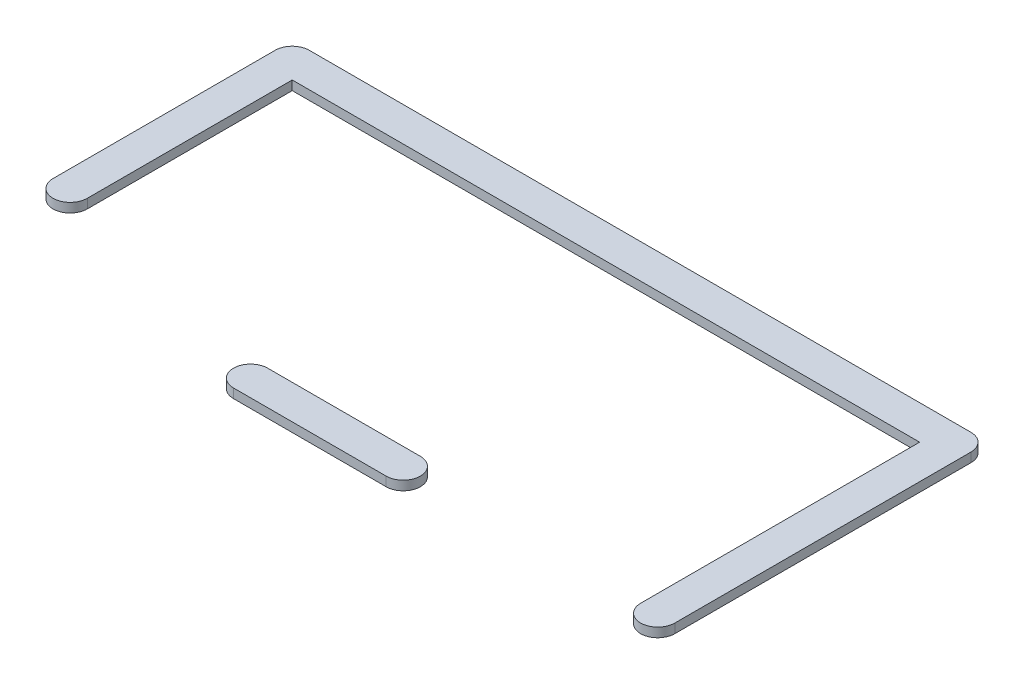
ISO-10303-21;
HEADER;
FILE_DESCRIPTION(('STEP AP214'),'2;1');
FILE_NAME('part.step','',(''),(''),'','','');
FILE_SCHEMA(('AUTOMOTIVE_DESIGN { 1 0 10303 214 1 1 1 1 }'));
ENDSEC;
DATA;
#1=APPLICATION_CONTEXT('core data for automotive mechanical design processes');
#2=APPLICATION_PROTOCOL_DEFINITION('international standard','automotive_design',2000,#1);
#3=PRODUCT_CONTEXT('',#1,'mechanical');
#4=PRODUCT('Part','Part','',(#3));
#5=PRODUCT_RELATED_PRODUCT_CATEGORY('part','',(#4));
#6=PRODUCT_DEFINITION_FORMATION('','',#4);
#7=PRODUCT_DEFINITION_CONTEXT('part definition',#1,'design');
#8=PRODUCT_DEFINITION('design','',#6,#7);
#9=PRODUCT_DEFINITION_SHAPE('','',#8);
#10=(LENGTH_UNIT() NAMED_UNIT(*) SI_UNIT(.MILLI.,.METRE.));
#11=(NAMED_UNIT(*) PLANE_ANGLE_UNIT() SI_UNIT($,.RADIAN.));
#12=(NAMED_UNIT(*) SI_UNIT($,.STERADIAN.) SOLID_ANGLE_UNIT());
#13=UNCERTAINTY_MEASURE_WITH_UNIT(LENGTH_MEASURE(1.E-05),#10,'distance_accuracy_value','');
#14=(GEOMETRIC_REPRESENTATION_CONTEXT(3) GLOBAL_UNCERTAINTY_ASSIGNED_CONTEXT((#13)) GLOBAL_UNIT_ASSIGNED_CONTEXT((#10,
#11,#12)) REPRESENTATION_CONTEXT('',''));
#15=CARTESIAN_POINT('',(0.,0.,0.));
#16=DIRECTION('',(0.,0.,1.));
#17=DIRECTION('',(1.,0.,0.));
#18=AXIS2_PLACEMENT_3D('',#15,#16,#17);
#19=CARTESIAN_POINT('',(550.,-20.,640.));
#20=DIRECTION('',(0.,1.,0.));
#21=DIRECTION('',(0.,0.,1.));
#22=AXIS2_PLACEMENT_3D('',#19,#20,#21);
#23=CYLINDRICAL_SURFACE('',#22,37.);
#24=CARTESIAN_POINT('',(550.,0.,640.));
#25=DIRECTION('',(0.,1.,0.));
#26=DIRECTION('',(0.,0.,1.));
#27=AXIS2_PLACEMENT_3D('',#24,#25,#26);
#28=CIRCLE('',#27,37.);
#29=CARTESIAN_POINT('',(550.,0.,603.));
#30=VERTEX_POINT('',#29);
#31=CARTESIAN_POINT('',(550.,0.,677.));
#32=VERTEX_POINT('',#31);
#33=EDGE_CURVE('E111',#30,#32,#28,.T.);
#34=ORIENTED_EDGE('',*,*,#33,.F.);
#35=DIRECTION('',(0.,1.,0.));
#36=VECTOR('',#35,1.);
#37=CARTESIAN_POINT('',(550.,-20.,603.));
#38=LINE('',#37,#36);
#39=CARTESIAN_POINT('',(550.,-20.,603.));
#40=VERTEX_POINT('',#39);
#41=EDGE_CURVE('E12',#40,#30,#38,.T.);
#42=ORIENTED_EDGE('',*,*,#41,.F.);
#43=CARTESIAN_POINT('',(550.,-20.,640.));
#44=DIRECTION('',(0.,1.,0.));
#45=DIRECTION('',(0.,0.,1.));
#46=AXIS2_PLACEMENT_3D('',#43,#44,#45);
#47=CIRCLE('',#46,37.);
#48=CARTESIAN_POINT('',(550.,-20.,677.));
#49=VERTEX_POINT('',#48);
#50=EDGE_CURVE('E105',#40,#49,#47,.T.);
#51=ORIENTED_EDGE('',*,*,#50,.T.);
#52=DIRECTION('',(0.,1.,0.));
#53=VECTOR('',#52,1.);
#54=CARTESIAN_POINT('',(550.,-20.,677.));
#55=LINE('',#54,#53);
#56=EDGE_CURVE('E50',#49,#32,#55,.T.);
#57=ORIENTED_EDGE('',*,*,#56,.T.);
#58=EDGE_LOOP('',(#34,#42,#51,#57));
#59=FACE_BOUND('',#58,.T.);
#60=ADVANCED_FACE('F47',(#59),#23,.T.);
#61=CARTESIAN_POINT('',(550.,-20.,603.));
#62=DIRECTION('',(0.,0.,-1.));
#63=DIRECTION('',(-1.,0.,0.));
#64=AXIS2_PLACEMENT_3D('',#61,#62,#63);
#65=PLANE('',#64);
#66=DIRECTION('',(-1.,0.,0.));
#67=VECTOR('',#66,1.);
#68=CARTESIAN_POINT('',(550.,0.,603.));
#69=LINE('',#68,#67);
#70=CARTESIAN_POINT('',(880.,0.,603.));
#71=VERTEX_POINT('',#70);
#72=EDGE_CURVE('E107',#71,#30,#69,.T.);
#73=ORIENTED_EDGE('',*,*,#72,.F.);
#74=DIRECTION('',(0.,1.,0.));
#75=VECTOR('',#74,1.);
#76=CARTESIAN_POINT('',(880.,-20.,603.));
#77=LINE('',#76,#75);
#78=CARTESIAN_POINT('',(880.,-20.,603.));
#79=VERTEX_POINT('',#78);
#80=EDGE_CURVE('E56',#79,#71,#77,.T.);
#81=ORIENTED_EDGE('',*,*,#80,.F.);
#82=DIRECTION('',(-1.,0.,0.));
#83=VECTOR('',#82,1.);
#84=CARTESIAN_POINT('',(550.,-20.,603.));
#85=LINE('',#84,#83);
#86=EDGE_CURVE('E102',#79,#40,#85,.T.);
#87=ORIENTED_EDGE('',*,*,#86,.T.);
#88=ORIENTED_EDGE('',*,*,#41,.T.);
#89=EDGE_LOOP('',(#73,#81,#87,#88));
#90=FACE_BOUND('',#89,.T.);
#91=ADVANCED_FACE('F121',(#90),#65,.T.);
#92=CARTESIAN_POINT('',(880.,-20.,640.));
#93=DIRECTION('',(0.,1.,0.));
#94=DIRECTION('',(0.,0.,1.));
#95=AXIS2_PLACEMENT_3D('',#92,#93,#94);
#96=CYLINDRICAL_SURFACE('',#95,37.);
#97=CARTESIAN_POINT('',(880.,0.,640.));
#98=DIRECTION('',(0.,1.,0.));
#99=DIRECTION('',(0.,0.,-1.));
#100=AXIS2_PLACEMENT_3D('',#97,#98,#99);
#101=CIRCLE('',#100,37.);
#102=CARTESIAN_POINT('',(880.,0.,677.));
#103=VERTEX_POINT('',#102);
#104=EDGE_CURVE('E97',#103,#71,#101,.T.);
#105=ORIENTED_EDGE('',*,*,#104,.F.);
#106=DIRECTION('',(0.,1.,0.));
#107=VECTOR('',#106,1.);
#108=CARTESIAN_POINT('',(880.,-20.,677.));
#109=LINE('',#108,#107);
#110=CARTESIAN_POINT('',(880.,-20.,677.));
#111=VERTEX_POINT('',#110);
#112=EDGE_CURVE('E92',#111,#103,#109,.T.);
#113=ORIENTED_EDGE('',*,*,#112,.F.);
#114=CARTESIAN_POINT('',(880.,-20.,640.));
#115=DIRECTION('',(0.,1.,0.));
#116=DIRECTION('',(0.,0.,-1.));
#117=AXIS2_PLACEMENT_3D('',#114,#115,#116);
#118=CIRCLE('',#117,37.);
#119=EDGE_CURVE('E95',#111,#79,#118,.T.);
#120=ORIENTED_EDGE('',*,*,#119,.T.);
#121=ORIENTED_EDGE('',*,*,#80,.T.);
#122=EDGE_LOOP('',(#105,#113,#120,#121));
#123=FACE_BOUND('',#122,.T.);
#124=ADVANCED_FACE('F94',(#123),#96,.T.);
#125=CARTESIAN_POINT('',(550.,-20.,677.));
#126=DIRECTION('',(0.,0.,1.));
#127=DIRECTION('',(1.,0.,0.));
#128=AXIS2_PLACEMENT_3D('',#125,#126,#127);
#129=PLANE('',#128);
#130=DIRECTION('',(1.,0.,0.));
#131=VECTOR('',#130,1.);
#132=CARTESIAN_POINT('',(550.,0.,677.));
#133=LINE('',#132,#131);
#134=EDGE_CURVE('E114',#32,#103,#133,.T.);
#135=ORIENTED_EDGE('',*,*,#134,.F.);
#136=ORIENTED_EDGE('',*,*,#56,.F.);
#137=DIRECTION('',(1.,0.,0.));
#138=VECTOR('',#137,1.);
#139=CARTESIAN_POINT('',(550.,-20.,677.));
#140=LINE('',#139,#138);
#141=EDGE_CURVE('E101',#49,#111,#140,.T.);
#142=ORIENTED_EDGE('',*,*,#141,.T.);
#143=ORIENTED_EDGE('',*,*,#112,.T.);
#144=EDGE_LOOP('',(#135,#136,#142,#143));
#145=FACE_BOUND('',#144,.T.);
#146=ADVANCED_FACE('F104',(#145),#129,.T.);
#147=CARTESIAN_POINT('',(550.,-20.,640.));
#148=DIRECTION('',(0.,1.,0.));
#149=DIRECTION('',(0.,0.,1.));
#150=AXIS2_PLACEMENT_3D('',#147,#148,#149);
#151=PLANE('',#150);
#152=ORIENTED_EDGE('',*,*,#50,.F.);
#153=ORIENTED_EDGE('',*,*,#86,.F.);
#154=ORIENTED_EDGE('',*,*,#119,.F.);
#155=ORIENTED_EDGE('',*,*,#141,.F.);
#156=EDGE_LOOP('',(#152,#153,#154,#155));
#157=FACE_BOUND('',#156,.T.);
#158=ADVANCED_FACE('F100',(#157),#151,.F.);
#159=CARTESIAN_POINT('',(550.,0.,640.));
#160=DIRECTION('',(0.,1.,0.));
#161=DIRECTION('',(0.,0.,1.));
#162=AXIS2_PLACEMENT_3D('',#159,#160,#161);
#163=PLANE('',#162);
#164=ORIENTED_EDGE('',*,*,#33,.T.);
#165=ORIENTED_EDGE('',*,*,#134,.T.);
#166=ORIENTED_EDGE('',*,*,#104,.T.);
#167=ORIENTED_EDGE('',*,*,#72,.T.);
#168=EDGE_LOOP('',(#164,#165,#166,#167));
#169=FACE_BOUND('',#168,.T.);
#170=ADVANCED_FACE('F120',(#169),#163,.T.);
#171=CLOSED_SHELL('',(#60,#91,#124,#146,#158,#170));
#172=MANIFOLD_SOLID_BREP('B2',#171);
#173=CARTESIAN_POINT('',(1430.,-20.,0.));
#174=DIRECTION('',(0.,1.,0.));
#175=DIRECTION('',(0.,0.,1.));
#176=AXIS2_PLACEMENT_3D('',#173,#174,#175);
#177=CYLINDRICAL_SURFACE('',#176,37.);
#178=CARTESIAN_POINT('',(1430.,0.,0.));
#179=DIRECTION('',(0.,1.,0.));
#180=DIRECTION('',(0.,0.,1.));
#181=AXIS2_PLACEMENT_3D('',#178,#179,#180);
#182=CIRCLE('',#181,37.);
#183=CARTESIAN_POINT('',(1467.,0.,0.));
#184=VERTEX_POINT('',#183);
#185=CARTESIAN_POINT('',(1430.,0.,-37.));
#186=VERTEX_POINT('',#185);
#187=EDGE_CURVE('E280',#184,#186,#182,.T.);
#188=ORIENTED_EDGE('',*,*,#187,.F.);
#189=DIRECTION('',(0.,1.,0.));
#190=VECTOR('',#189,1.);
#191=CARTESIAN_POINT('',(1467.,-20.,0.));
#192=LINE('',#191,#190);
#193=CARTESIAN_POINT('',(1467.,-20.,0.));
#194=VERTEX_POINT('',#193);
#195=EDGE_CURVE('E45',#194,#184,#192,.T.);
#196=ORIENTED_EDGE('',*,*,#195,.F.);
#197=CARTESIAN_POINT('',(1430.,-20.,0.));
#198=DIRECTION('',(0.,1.,0.));
#199=DIRECTION('',(0.,0.,1.));
#200=AXIS2_PLACEMENT_3D('',#197,#198,#199);
#201=CIRCLE('',#200,37.);
#202=CARTESIAN_POINT('',(1430.,-20.,-37.));
#203=VERTEX_POINT('',#202);
#204=EDGE_CURVE('E306',#194,#203,#201,.T.);
#205=ORIENTED_EDGE('',*,*,#204,.T.);
#206=DIRECTION('',(0.,1.,0.));
#207=VECTOR('',#206,1.);
#208=CARTESIAN_POINT('',(1430.,-20.,-37.));
#209=LINE('',#208,#207);
#210=EDGE_CURVE('E174',#203,#186,#209,.T.);
#211=ORIENTED_EDGE('',*,*,#210,.T.);
#212=EDGE_LOOP('',(#188,#196,#205,#211));
#213=FACE_BOUND('',#212,.T.);
#214=ADVANCED_FACE('F171',(#213),#177,.T.);
#215=CARTESIAN_POINT('',(1467.,-20.,0.));
#216=DIRECTION('',(1.,0.,0.));
#217=DIRECTION('',(0.,0.,-1.));
#218=AXIS2_PLACEMENT_3D('',#215,#216,#217);
#219=PLANE('',#218);
#220=DIRECTION('',(0.,0.,-1.));
#221=VECTOR('',#220,1.);
#222=CARTESIAN_POINT('',(1467.,0.,0.));
#223=LINE('',#222,#221);
#224=CARTESIAN_POINT('',(1467.,0.,640.));
#225=VERTEX_POINT('',#224);
#226=EDGE_CURVE('E304',#225,#184,#223,.T.);
#227=ORIENTED_EDGE('',*,*,#226,.F.);
#228=DIRECTION('',(0.,1.,0.));
#229=VECTOR('',#228,1.);
#230=CARTESIAN_POINT('',(1467.,-20.,640.));
#231=LINE('',#230,#229);
#232=CARTESIAN_POINT('',(1467.,-20.,640.));
#233=VERTEX_POINT('',#232);
#234=EDGE_CURVE('E180',#233,#225,#231,.T.);
#235=ORIENTED_EDGE('',*,*,#234,.F.);
#236=DIRECTION('',(0.,0.,-1.));
#237=VECTOR('',#236,1.);
#238=CARTESIAN_POINT('',(1467.,-20.,0.));
#239=LINE('',#238,#237);
#240=EDGE_CURVE('E270',#233,#194,#239,.T.);
#241=ORIENTED_EDGE('',*,*,#240,.T.);
#242=ORIENTED_EDGE('',*,*,#195,.T.);
#243=EDGE_LOOP('',(#227,#235,#241,#242));
#244=FACE_BOUND('',#243,.T.);
#245=ADVANCED_FACE('F322',(#244),#219,.T.);
#246=CARTESIAN_POINT('',(1430.,-20.,640.));
#247=DIRECTION('',(0.,1.,0.));
#248=DIRECTION('',(0.,0.,1.));
#249=AXIS2_PLACEMENT_3D('',#246,#247,#248);
#250=CYLINDRICAL_SURFACE('',#249,36.9999999999999);
#251=CARTESIAN_POINT('',(1430.,0.,640.));
#252=DIRECTION('',(0.,1.,0.));
#253=DIRECTION('',(0.,0.,1.));
#254=AXIS2_PLACEMENT_3D('',#251,#252,#253);
#255=CIRCLE('',#254,36.9999999999999);
#256=CARTESIAN_POINT('',(1393.,0.,640.));
#257=VERTEX_POINT('',#256);
#258=EDGE_CURVE('E257',#257,#225,#255,.T.);
#259=ORIENTED_EDGE('',*,*,#258,.F.);
#260=DIRECTION('',(0.,1.,0.));
#261=VECTOR('',#260,1.);
#262=CARTESIAN_POINT('',(1393.,-20.,640.));
#263=LINE('',#262,#261);
#264=CARTESIAN_POINT('',(1393.,-20.,640.));
#265=VERTEX_POINT('',#264);
#266=EDGE_CURVE('E252',#265,#257,#263,.T.);
#267=ORIENTED_EDGE('',*,*,#266,.F.);
#268=CARTESIAN_POINT('',(1430.,-20.,640.));
#269=DIRECTION('',(0.,1.,0.));
#270=DIRECTION('',(0.,0.,1.));
#271=AXIS2_PLACEMENT_3D('',#268,#269,#270);
#272=CIRCLE('',#271,36.9999999999999);
#273=EDGE_CURVE('E255',#265,#233,#272,.T.);
#274=ORIENTED_EDGE('',*,*,#273,.T.);
#275=ORIENTED_EDGE('',*,*,#234,.T.);
#276=EDGE_LOOP('',(#259,#267,#274,#275));
#277=FACE_BOUND('',#276,.T.);
#278=ADVANCED_FACE('F254',(#277),#250,.T.);
#279=CARTESIAN_POINT('',(1393.,-20.,37.));
#280=DIRECTION('',(-1.,0.,0.));
#281=DIRECTION('',(0.,0.,1.));
#282=AXIS2_PLACEMENT_3D('',#279,#280,#281);
#283=PLANE('',#282);
#284=DIRECTION('',(0.,0.,1.));
#285=VECTOR('',#284,1.);
#286=CARTESIAN_POINT('',(1393.,0.,37.));
#287=LINE('',#286,#285);
#288=CARTESIAN_POINT('',(1393.,0.,37.));
#289=VERTEX_POINT('',#288);
#290=EDGE_CURVE('E301',#289,#257,#287,.T.);
#291=ORIENTED_EDGE('',*,*,#290,.F.);
#292=DIRECTION('',(0.,1.,0.));
#293=VECTOR('',#292,1.);
#294=CARTESIAN_POINT('',(1393.,-20.,37.));
#295=LINE('',#294,#293);
#296=CARTESIAN_POINT('',(1393.,-20.,37.));
#297=VERTEX_POINT('',#296);
#298=EDGE_CURVE('E262',#297,#289,#295,.T.);
#299=ORIENTED_EDGE('',*,*,#298,.F.);
#300=DIRECTION('',(0.,0.,1.));
#301=VECTOR('',#300,1.);
#302=CARTESIAN_POINT('',(1393.,-20.,37.));
#303=LINE('',#302,#301);
#304=EDGE_CURVE('E268',#297,#265,#303,.T.);
#305=ORIENTED_EDGE('',*,*,#304,.T.);
#306=ORIENTED_EDGE('',*,*,#266,.T.);
#307=EDGE_LOOP('',(#291,#299,#305,#306));
#308=FACE_BOUND('',#307,.T.);
#309=ADVANCED_FACE('F272',(#308),#283,.T.);
#310=CARTESIAN_POINT('',(37.,-20.,37.));
#311=DIRECTION('',(0.,0.,1.));
#312=DIRECTION('',(1.,0.,0.));
#313=AXIS2_PLACEMENT_3D('',#310,#311,#312);
#314=PLANE('',#313);
#315=DIRECTION('',(1.,0.,0.));
#316=VECTOR('',#315,1.);
#317=CARTESIAN_POINT('',(37.,0.,37.));
#318=LINE('',#317,#316);
#319=CARTESIAN_POINT('',(37.,0.,37.));
#320=VERTEX_POINT('',#319);
#321=EDGE_CURVE('E298',#320,#289,#318,.T.);
#322=ORIENTED_EDGE('',*,*,#321,.F.);
#323=DIRECTION('',(0.,1.,0.));
#324=VECTOR('',#323,1.);
#325=CARTESIAN_POINT('',(37.,-20.,37.));
#326=LINE('',#325,#324);
#327=CARTESIAN_POINT('',(37.,-20.,37.));
#328=VERTEX_POINT('',#327);
#329=EDGE_CURVE('E310',#328,#320,#326,.T.);
#330=ORIENTED_EDGE('',*,*,#329,.F.);
#331=DIRECTION('',(1.,0.,0.));
#332=VECTOR('',#331,1.);
#333=CARTESIAN_POINT('',(37.,-20.,37.));
#334=LINE('',#333,#332);
#335=EDGE_CURVE('E273',#328,#297,#334,.T.);
#336=ORIENTED_EDGE('',*,*,#335,.T.);
#337=ORIENTED_EDGE('',*,*,#298,.T.);
#338=EDGE_LOOP('',(#322,#330,#336,#337));
#339=FACE_BOUND('',#338,.T.);
#340=ADVANCED_FACE('F335',(#339),#314,.T.);
#341=CARTESIAN_POINT('',(37.,-20.,480.));
#342=DIRECTION('',(1.,0.,0.));
#343=DIRECTION('',(0.,0.,-1.));
#344=AXIS2_PLACEMENT_3D('',#341,#342,#343);
#345=PLANE('',#344);
#346=DIRECTION('',(0.,0.,-1.));
#347=VECTOR('',#346,1.);
#348=CARTESIAN_POINT('',(37.,0.,480.));
#349=LINE('',#348,#347);
#350=CARTESIAN_POINT('',(37.,0.,480.));
#351=VERTEX_POINT('',#350);
#352=EDGE_CURVE('E295',#351,#320,#349,.T.);
#353=ORIENTED_EDGE('',*,*,#352,.F.);
#354=DIRECTION('',(0.,1.,0.));
#355=VECTOR('',#354,1.);
#356=CARTESIAN_POINT('',(37.,-20.,480.));
#357=LINE('',#356,#355);
#358=CARTESIAN_POINT('',(37.,-20.,480.));
#359=VERTEX_POINT('',#358);
#360=EDGE_CURVE('E312',#359,#351,#357,.T.);
#361=ORIENTED_EDGE('',*,*,#360,.F.);
#362=DIRECTION('',(0.,0.,-1.));
#363=VECTOR('',#362,1.);
#364=CARTESIAN_POINT('',(37.,-20.,480.));
#365=LINE('',#364,#363);
#366=EDGE_CURVE('E275',#359,#328,#365,.T.);
#367=ORIENTED_EDGE('',*,*,#366,.T.);
#368=ORIENTED_EDGE('',*,*,#329,.T.);
#369=EDGE_LOOP('',(#353,#361,#367,#368));
#370=FACE_BOUND('',#369,.T.);
#371=ADVANCED_FACE('F338',(#370),#345,.T.);
#372=CARTESIAN_POINT('',(0.,-20.,480.));
#373=DIRECTION('',(0.,1.,0.));
#374=DIRECTION('',(0.,0.,1.));
#375=AXIS2_PLACEMENT_3D('',#372,#373,#374);
#376=CYLINDRICAL_SURFACE('',#375,37.);
#377=CARTESIAN_POINT('',(0.,0.,480.));
#378=DIRECTION('',(0.,1.,0.));
#379=DIRECTION('',(0.,0.,1.));
#380=AXIS2_PLACEMENT_3D('',#377,#378,#379);
#381=CIRCLE('',#380,37.);
#382=CARTESIAN_POINT('',(-37.,0.,480.));
#383=VERTEX_POINT('',#382);
#384=EDGE_CURVE('E292',#383,#351,#381,.T.);
#385=ORIENTED_EDGE('',*,*,#384,.F.);
#386=DIRECTION('',(0.,1.,0.));
#387=VECTOR('',#386,1.);
#388=CARTESIAN_POINT('',(-37.,-20.,480.));
#389=LINE('',#388,#387);
#390=CARTESIAN_POINT('',(-37.,-20.,480.));
#391=VERTEX_POINT('',#390);
#392=EDGE_CURVE('E314',#391,#383,#389,.T.);
#393=ORIENTED_EDGE('',*,*,#392,.F.);
#394=CARTESIAN_POINT('',(0.,-20.,480.));
#395=DIRECTION('',(0.,1.,0.));
#396=DIRECTION('',(0.,0.,1.));
#397=AXIS2_PLACEMENT_3D('',#394,#395,#396);
#398=CIRCLE('',#397,37.);
#399=EDGE_CURVE('E437',#391,#359,#398,.T.);
#400=ORIENTED_EDGE('',*,*,#399,.T.);
#401=ORIENTED_EDGE('',*,*,#360,.T.);
#402=EDGE_LOOP('',(#385,#393,#400,#401));
#403=FACE_BOUND('',#402,.T.);
#404=ADVANCED_FACE('F342',(#403),#376,.T.);
#405=CARTESIAN_POINT('',(-37.,-20.,480.));
#406=DIRECTION('',(-1.,0.,0.));
#407=DIRECTION('',(0.,0.,1.));
#408=AXIS2_PLACEMENT_3D('',#405,#406,#407);
#409=PLANE('',#408);
#410=DIRECTION('',(0.,0.,1.));
#411=VECTOR('',#410,1.);
#412=CARTESIAN_POINT('',(-37.,0.,480.));
#413=LINE('',#412,#411);
#414=CARTESIAN_POINT('',(-37.,0.,0.));
#415=VERTEX_POINT('',#414);
#416=EDGE_CURVE('E289',#415,#383,#413,.T.);
#417=ORIENTED_EDGE('',*,*,#416,.F.);
#418=DIRECTION('',(0.,1.,0.));
#419=VECTOR('',#418,1.);
#420=CARTESIAN_POINT('',(-37.,-20.,0.));
#421=LINE('',#420,#419);
#422=CARTESIAN_POINT('',(-37.,-20.,0.));
#423=VERTEX_POINT('',#422);
#424=EDGE_CURVE('E316',#423,#415,#421,.T.);
#425=ORIENTED_EDGE('',*,*,#424,.F.);
#426=DIRECTION('',(0.,0.,1.));
#427=VECTOR('',#426,1.);
#428=CARTESIAN_POINT('',(-37.,-20.,480.));
#429=LINE('',#428,#427);
#430=EDGE_CURVE('E433',#423,#391,#429,.T.);
#431=ORIENTED_EDGE('',*,*,#430,.T.);
#432=ORIENTED_EDGE('',*,*,#392,.T.);
#433=EDGE_LOOP('',(#417,#425,#431,#432));
#434=FACE_BOUND('',#433,.T.);
#435=ADVANCED_FACE('F346',(#434),#409,.T.);
#436=CARTESIAN_POINT('',(0.,-20.,0.));
#437=DIRECTION('',(0.,1.,0.));
#438=DIRECTION('',(0.,0.,1.));
#439=AXIS2_PLACEMENT_3D('',#436,#437,#438);
#440=CYLINDRICAL_SURFACE('',#439,37.);
#441=CARTESIAN_POINT('',(0.,0.,0.));
#442=DIRECTION('',(0.,1.,0.));
#443=DIRECTION('',(0.,0.,1.));
#444=AXIS2_PLACEMENT_3D('',#441,#442,#443);
#445=CIRCLE('',#444,37.);
#446=CARTESIAN_POINT('',(0.,0.,-37.));
#447=VERTEX_POINT('',#446);
#448=EDGE_CURVE('E286',#447,#415,#445,.T.);
#449=ORIENTED_EDGE('',*,*,#448,.F.);
#450=DIRECTION('',(0.,1.,0.));
#451=VECTOR('',#450,1.);
#452=CARTESIAN_POINT('',(0.,-20.,-37.));
#453=LINE('',#452,#451);
#454=CARTESIAN_POINT('',(0.,-20.,-37.));
#455=VERTEX_POINT('',#454);
#456=EDGE_CURVE('E317',#455,#447,#453,.T.);
#457=ORIENTED_EDGE('',*,*,#456,.F.);
#458=CARTESIAN_POINT('',(0.,-20.,0.));
#459=DIRECTION('',(0.,1.,0.));
#460=DIRECTION('',(0.,0.,1.));
#461=AXIS2_PLACEMENT_3D('',#458,#459,#460);
#462=CIRCLE('',#461,37.);
#463=EDGE_CURVE('E444',#455,#423,#462,.T.);
#464=ORIENTED_EDGE('',*,*,#463,.T.);
#465=ORIENTED_EDGE('',*,*,#424,.T.);
#466=EDGE_LOOP('',(#449,#457,#464,#465));
#467=FACE_BOUND('',#466,.T.);
#468=ADVANCED_FACE('F350',(#467),#440,.T.);
#469=CARTESIAN_POINT('',(0.,-20.,-37.));
#470=DIRECTION('',(0.,0.,-1.));
#471=DIRECTION('',(-1.,0.,0.));
#472=AXIS2_PLACEMENT_3D('',#469,#470,#471);
#473=PLANE('',#472);
#474=DIRECTION('',(-1.,0.,0.));
#475=VECTOR('',#474,1.);
#476=CARTESIAN_POINT('',(0.,0.,-37.));
#477=LINE('',#476,#475);
#478=EDGE_CURVE('E283',#186,#447,#477,.T.);
#479=ORIENTED_EDGE('',*,*,#478,.F.);
#480=ORIENTED_EDGE('',*,*,#210,.F.);
#481=DIRECTION('',(-1.,0.,0.));
#482=VECTOR('',#481,1.);
#483=CARTESIAN_POINT('',(0.,-20.,-37.));
#484=LINE('',#483,#482);
#485=EDGE_CURVE('E446',#203,#455,#484,.T.);
#486=ORIENTED_EDGE('',*,*,#485,.T.);
#487=ORIENTED_EDGE('',*,*,#456,.T.);
#488=EDGE_LOOP('',(#479,#480,#486,#487));
#489=FACE_BOUND('',#488,.T.);
#490=ADVANCED_FACE('F319',(#489),#473,.T.);
#491=CARTESIAN_POINT('',(1430.,-20.,0.));
#492=DIRECTION('',(0.,1.,0.));
#493=DIRECTION('',(0.,0.,1.));
#494=AXIS2_PLACEMENT_3D('',#491,#492,#493);
#495=PLANE('',#494);
#496=ORIENTED_EDGE('',*,*,#204,.F.);
#497=ORIENTED_EDGE('',*,*,#240,.F.);
#498=ORIENTED_EDGE('',*,*,#273,.F.);
#499=ORIENTED_EDGE('',*,*,#304,.F.);
#500=ORIENTED_EDGE('',*,*,#335,.F.);
#501=ORIENTED_EDGE('',*,*,#366,.F.);
#502=ORIENTED_EDGE('',*,*,#399,.F.);
#503=ORIENTED_EDGE('',*,*,#430,.F.);
#504=ORIENTED_EDGE('',*,*,#463,.F.);
#505=ORIENTED_EDGE('',*,*,#485,.F.);
#506=EDGE_LOOP('',(#496,#497,#498,#499,#500,#501,#502,#503,#504,#505));
#507=FACE_BOUND('',#506,.T.);
#508=ADVANCED_FACE('F266',(#507),#495,.F.);
#509=CARTESIAN_POINT('',(1430.,0.,0.));
#510=DIRECTION('',(0.,1.,0.));
#511=DIRECTION('',(0.,0.,1.));
#512=AXIS2_PLACEMENT_3D('',#509,#510,#511);
#513=PLANE('',#512);
#514=ORIENTED_EDGE('',*,*,#187,.T.);
#515=ORIENTED_EDGE('',*,*,#478,.T.);
#516=ORIENTED_EDGE('',*,*,#448,.T.);
#517=ORIENTED_EDGE('',*,*,#416,.T.);
#518=ORIENTED_EDGE('',*,*,#384,.T.);
#519=ORIENTED_EDGE('',*,*,#352,.T.);
#520=ORIENTED_EDGE('',*,*,#321,.T.);
#521=ORIENTED_EDGE('',*,*,#290,.T.);
#522=ORIENTED_EDGE('',*,*,#258,.T.);
#523=ORIENTED_EDGE('',*,*,#226,.T.);
#524=EDGE_LOOP('',(#514,#515,#516,#517,#518,#519,#520,#521,#522,#523));
#525=FACE_BOUND('',#524,.T.);
#526=ADVANCED_FACE('F321',(#525),#513,.T.);
#527=CLOSED_SHELL('',(#214,#245,#278,#309,#340,#371,#404,#435,#468,#490,#508,#526));
#528=MANIFOLD_SOLID_BREP('B6',#527);
#529=ADVANCED_BREP_SHAPE_REPRESENTATION('',(#18,#172,#528),#14);
#530=SHAPE_DEFINITION_REPRESENTATION(#9,#529);
ENDSEC;
END-ISO-10303-21;
